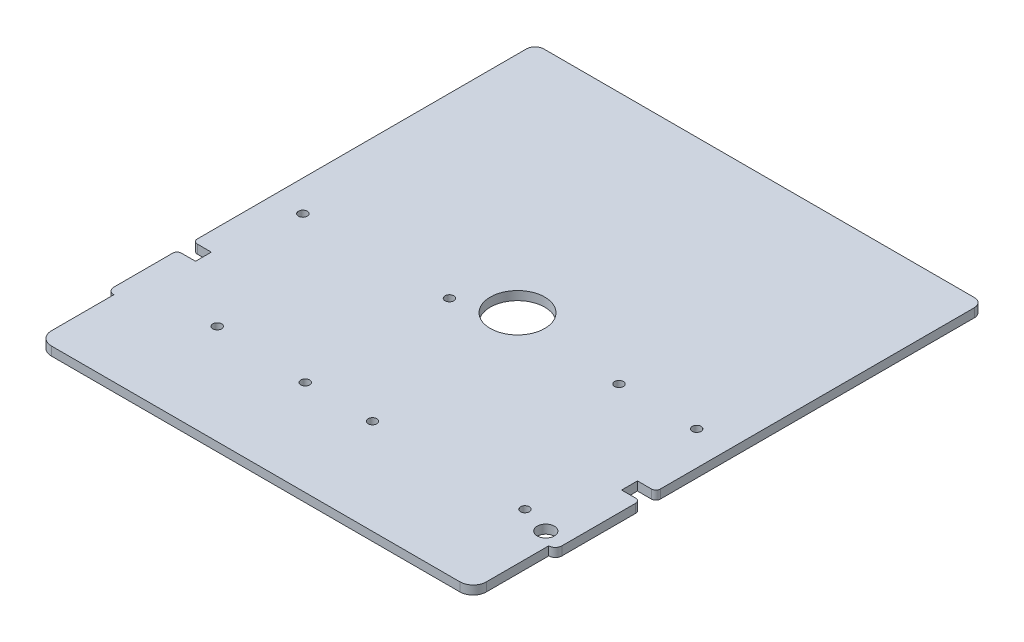
ISO-10303-21;
HEADER;
FILE_DESCRIPTION(('STEP AP214'),'2;1');
FILE_NAME('part.step','',(''),(''),'','','');
FILE_SCHEMA(('AUTOMOTIVE_DESIGN { 1 0 10303 214 1 1 1 1 }'));
ENDSEC;
DATA;
#1=APPLICATION_CONTEXT('core data for automotive mechanical design processes');
#2=APPLICATION_PROTOCOL_DEFINITION('international standard','automotive_design',2000,#1);
#3=PRODUCT_CONTEXT('',#1,'mechanical');
#4=PRODUCT('Part','Part','',(#3));
#5=PRODUCT_RELATED_PRODUCT_CATEGORY('part','',(#4));
#6=PRODUCT_DEFINITION_FORMATION('','',#4);
#7=PRODUCT_DEFINITION_CONTEXT('part definition',#1,'design');
#8=PRODUCT_DEFINITION('design','',#6,#7);
#9=PRODUCT_DEFINITION_SHAPE('','',#8);
#10=(LENGTH_UNIT() NAMED_UNIT(*) SI_UNIT(.MILLI.,.METRE.));
#11=(NAMED_UNIT(*) PLANE_ANGLE_UNIT() SI_UNIT($,.RADIAN.));
#12=(NAMED_UNIT(*) SI_UNIT($,.STERADIAN.) SOLID_ANGLE_UNIT());
#13=UNCERTAINTY_MEASURE_WITH_UNIT(LENGTH_MEASURE(1.E-05),#10,'distance_accuracy_value','');
#14=(GEOMETRIC_REPRESENTATION_CONTEXT(3) GLOBAL_UNCERTAINTY_ASSIGNED_CONTEXT((#13)) GLOBAL_UNIT_ASSIGNED_CONTEXT((#10,
#11,#12)) REPRESENTATION_CONTEXT('',''));
#15=CARTESIAN_POINT('',(0.,0.,0.));
#16=DIRECTION('',(0.,0.,1.));
#17=DIRECTION('',(1.,0.,0.));
#18=AXIS2_PLACEMENT_3D('',#15,#16,#17);
#19=CARTESIAN_POINT('',(0.,1.,1.));
#20=DIRECTION('',(1.,0.,0.));
#21=DIRECTION('',(0.,0.,-1.));
#22=AXIS2_PLACEMENT_3D('',#19,#20,#21);
#23=PLANE('',#22);
#24=DIRECTION('',(0.,0.,1.));
#25=VECTOR('',#24,1.);
#26=CARTESIAN_POINT('',(0.,0.,1.));
#27=LINE('',#26,#25);
#28=CARTESIAN_POINT('',(0.,0.,-25.5));
#29=VERTEX_POINT('',#28);
#30=CARTESIAN_POINT('',(0.,0.,11.95));
#31=VERTEX_POINT('',#30);
#32=EDGE_CURVE('E415',#29,#31,#27,.T.);
#33=ORIENTED_EDGE('',*,*,#32,.T.);
#34=DIRECTION('',(0.,1.,0.));
#35=VECTOR('',#34,1.);
#36=CARTESIAN_POINT('',(0.,1.,11.95));
#37=LINE('',#36,#35);
#38=CARTESIAN_POINT('',(0.,1.,11.95));
#39=VERTEX_POINT('',#38);
#40=EDGE_CURVE('E490',#31,#39,#37,.T.);
#41=ORIENTED_EDGE('',*,*,#40,.T.);
#42=DIRECTION('',(0.,0.,1.));
#43=VECTOR('',#42,1.);
#44=CARTESIAN_POINT('',(0.,1.,1.));
#45=LINE('',#44,#43);
#46=CARTESIAN_POINT('',(0.,1.,-25.5));
#47=VERTEX_POINT('',#46);
#48=EDGE_CURVE('E385',#47,#39,#45,.T.);
#49=ORIENTED_EDGE('',*,*,#48,.F.);
#50=DIRECTION('',(0.,-1.,0.));
#51=VECTOR('',#50,1.);
#52=CARTESIAN_POINT('',(0.,1.,-25.5));
#53=LINE('',#52,#51);
#54=EDGE_CURVE('E461',#47,#29,#53,.T.);
#55=ORIENTED_EDGE('',*,*,#54,.T.);
#56=EDGE_LOOP('',(#33,#41,#49,#55));
#57=FACE_BOUND('',#56,.T.);
#58=ADVANCED_FACE('F151',(#57),#23,.F.);
#59=CARTESIAN_POINT('',(0.,1.,14.75));
#60=VERTEX_POINT('',#59);
#61=CARTESIAN_POINT('',(0.,1.,21.45));
#62=VERTEX_POINT('',#61);
#63=EDGE_CURVE('E384',#60,#62,#45,.T.);
#64=ORIENTED_EDGE('',*,*,#63,.F.);
#65=DIRECTION('',(0.,1.,0.));
#66=VECTOR('',#65,1.);
#67=CARTESIAN_POINT('',(0.,0.,14.75));
#68=LINE('',#67,#66);
#69=CARTESIAN_POINT('',(0.,0.,14.75));
#70=VERTEX_POINT('',#69);
#71=EDGE_CURVE('E481',#60,#70,#68,.F.);
#72=ORIENTED_EDGE('',*,*,#71,.T.);
#73=CARTESIAN_POINT('',(0.,0.,21.45));
#74=VERTEX_POINT('',#73);
#75=EDGE_CURVE('E414',#70,#74,#27,.T.);
#76=ORIENTED_EDGE('',*,*,#75,.T.);
#77=DIRECTION('',(0.,-1.,0.));
#78=VECTOR('',#77,1.);
#79=CARTESIAN_POINT('',(0.,1.,21.45));
#80=LINE('',#79,#78);
#81=EDGE_CURVE('E458',#62,#74,#80,.T.);
#82=ORIENTED_EDGE('',*,*,#81,.F.);
#83=EDGE_LOOP('',(#64,#72,#76,#82));
#84=FACE_BOUND('',#83,.T.);
#85=ADVANCED_FACE('F599',(#84),#23,.F.);
#86=CARTESIAN_POINT('',(51.,1.,-25.5));
#87=DIRECTION('',(-1.,0.,0.));
#88=DIRECTION('',(0.,0.,1.));
#89=AXIS2_PLACEMENT_3D('',#86,#87,#88);
#90=PLANE('',#89);
#91=DIRECTION('',(0.,0.,-1.));
#92=VECTOR('',#91,1.);
#93=CARTESIAN_POINT('',(51.,1.,21.45));
#94=LINE('',#93,#92);
#95=CARTESIAN_POINT('',(51.,1.,10.25));
#96=VERTEX_POINT('',#95);
#97=CARTESIAN_POINT('',(51.,1.,-25.5));
#98=VERTEX_POINT('',#97);
#99=EDGE_CURVE('E402',#96,#98,#94,.T.);
#100=ORIENTED_EDGE('',*,*,#99,.F.);
#101=DIRECTION('',(0.,1.,0.));
#102=VECTOR('',#101,1.);
#103=CARTESIAN_POINT('',(51.,1.,10.25));
#104=LINE('',#103,#102);
#105=CARTESIAN_POINT('',(51.,0.,10.25));
#106=VERTEX_POINT('',#105);
#107=EDGE_CURVE('E12',#96,#106,#104,.F.);
#108=ORIENTED_EDGE('',*,*,#107,.T.);
#109=DIRECTION('',(0.,0.,-1.));
#110=VECTOR('',#109,1.);
#111=CARTESIAN_POINT('',(51.,0.,-25.5));
#112=LINE('',#111,#110);
#113=CARTESIAN_POINT('',(51.,0.,-25.5));
#114=VERTEX_POINT('',#113);
#115=EDGE_CURVE('E433',#106,#114,#112,.T.);
#116=ORIENTED_EDGE('',*,*,#115,.T.);
#117=DIRECTION('',(0.,-1.,0.));
#118=VECTOR('',#117,1.);
#119=CARTESIAN_POINT('',(51.,1.,-25.5));
#120=LINE('',#119,#118);
#121=EDGE_CURVE('E406',#98,#114,#120,.T.);
#122=ORIENTED_EDGE('',*,*,#121,.F.);
#123=EDGE_LOOP('',(#100,#108,#116,#122));
#124=FACE_BOUND('',#123,.T.);
#125=ADVANCED_FACE('F587',(#124),#90,.F.);
#126=CARTESIAN_POINT('',(50.,1.,-25.5));
#127=DIRECTION('',(0.,-1.,0.));
#128=DIRECTION('',(0.,0.,-1.));
#129=AXIS2_PLACEMENT_3D('',#126,#127,#128);
#130=PLANE('',#129);
#131=CARTESIAN_POINT('',(3.52,1.,3.45));
#132=DIRECTION('',(0.,1.,0.));
#133=DIRECTION('',(0.,0.,1.));
#134=AXIS2_PLACEMENT_3D('',#131,#132,#133);
#135=CIRCLE('',#134,0.500000000000001);
#136=CARTESIAN_POINT('',(3.52,1.,3.95));
#137=VERTEX_POINT('',#136);
#138=EDGE_CURVE('E945',#137,#137,#135,.T.);
#139=ORIENTED_EDGE('',*,*,#138,.F.);
#140=EDGE_LOOP('',(#139));
#141=FACE_BOUND('',#140,.T.);
#142=CARTESIAN_POINT('',(9.75,1.,19.43));
#143=DIRECTION('',(0.,1.,0.));
#144=DIRECTION('',(0.,0.,1.));
#145=AXIS2_PLACEMENT_3D('',#142,#143,#144);
#146=CIRCLE('',#145,0.500000000000001);
#147=CARTESIAN_POINT('',(9.75,1.,19.93));
#148=VERTEX_POINT('',#147);
#149=EDGE_CURVE('E972',#148,#148,#146,.T.);
#150=ORIENTED_EDGE('',*,*,#149,.F.);
#151=EDGE_LOOP('',(#150));
#152=FACE_BOUND('',#151,.T.);
#153=CARTESIAN_POINT('',(20.29,1.,19.95));
#154=DIRECTION('',(0.,1.,0.));
#155=DIRECTION('',(0.,0.,1.));
#156=AXIS2_PLACEMENT_3D('',#153,#154,#155);
#157=CIRCLE('',#156,0.499999999999999);
#158=CARTESIAN_POINT('',(20.29,1.,20.45));
#159=VERTEX_POINT('',#158);
#160=EDGE_CURVE('E966',#159,#159,#157,.T.);
#161=ORIENTED_EDGE('',*,*,#160,.F.);
#162=EDGE_LOOP('',(#161));
#163=FACE_BOUND('',#162,.T.);
#164=CARTESIAN_POINT('',(27.94,1.,19.95));
#165=DIRECTION('',(0.,1.,0.));
#166=DIRECTION('',(0.,0.,1.));
#167=AXIS2_PLACEMENT_3D('',#164,#165,#166);
#168=CIRCLE('',#167,0.499999999999999);
#169=CARTESIAN_POINT('',(27.94,1.,20.45));
#170=VERTEX_POINT('',#169);
#171=EDGE_CURVE('E960',#170,#170,#168,.T.);
#172=ORIENTED_EDGE('',*,*,#171,.F.);
#173=EDGE_LOOP('',(#172));
#174=FACE_BOUND('',#173,.T.);
#175=CARTESIAN_POINT('',(45.29,1.,19.95));
#176=DIRECTION('',(0.,1.,0.));
#177=DIRECTION('',(0.,0.,1.));
#178=AXIS2_PLACEMENT_3D('',#175,#176,#177);
#179=CIRCLE('',#178,0.499999999999999);
#180=CARTESIAN_POINT('',(45.29,1.,20.45));
#181=VERTEX_POINT('',#180);
#182=EDGE_CURVE('E953',#181,#181,#179,.T.);
#183=ORIENTED_EDGE('',*,*,#182,.F.);
#184=EDGE_LOOP('',(#183));
#185=FACE_BOUND('',#184,.T.);
#186=CARTESIAN_POINT('',(48.627,1.,20.91));
#187=DIRECTION('',(0.,1.,0.));
#188=DIRECTION('',(0.,0.,1.));
#189=AXIS2_PLACEMENT_3D('',#186,#187,#188);
#190=CIRCLE('',#189,0.975);
#191=CARTESIAN_POINT('',(48.627,1.,21.885));
#192=VERTEX_POINT('',#191);
#193=EDGE_CURVE('E992',#192,#192,#190,.T.);
#194=ORIENTED_EDGE('',*,*,#193,.F.);
#195=EDGE_LOOP('',(#194));
#196=FACE_BOUND('',#195,.T.);
#197=CARTESIAN_POINT('',(47.14,1.,2.25));
#198=DIRECTION('',(0.,1.,0.));
#199=DIRECTION('',(0.,0.,1.));
#200=AXIS2_PLACEMENT_3D('',#197,#198,#199);
#201=CIRCLE('',#200,0.499999999999999);
#202=CARTESIAN_POINT('',(47.14,1.,2.74999999999999));
#203=VERTEX_POINT('',#202);
#204=EDGE_CURVE('E986',#203,#203,#201,.T.);
#205=ORIENTED_EDGE('',*,*,#204,.F.);
#206=EDGE_LOOP('',(#205));
#207=FACE_BOUND('',#206,.T.);
#208=CARTESIAN_POINT('',(38.3,1.,2.25));
#209=DIRECTION('',(0.,1.,0.));
#210=DIRECTION('',(0.,0.,1.));
#211=AXIS2_PLACEMENT_3D('',#208,#209,#210);
#212=CIRCLE('',#211,0.499999999999999);
#213=CARTESIAN_POINT('',(38.3,1.,2.74999999999999));
#214=VERTEX_POINT('',#213);
#215=EDGE_CURVE('E980',#214,#214,#212,.T.);
#216=ORIENTED_EDGE('',*,*,#215,.F.);
#217=EDGE_LOOP('',(#216));
#218=FACE_BOUND('',#217,.T.);
#219=CARTESIAN_POINT('',(20.2,1.,3.45));
#220=DIRECTION('',(0.,1.,0.));
#221=DIRECTION('',(0.,0.,1.));
#222=AXIS2_PLACEMENT_3D('',#219,#220,#221);
#223=CIRCLE('',#222,0.499999999999999);
#224=CARTESIAN_POINT('',(20.2,1.,3.95));
#225=VERTEX_POINT('',#224);
#226=EDGE_CURVE('E946',#225,#225,#223,.T.);
#227=ORIENTED_EDGE('',*,*,#226,.F.);
#228=EDGE_LOOP('',(#227));
#229=FACE_BOUND('',#228,.T.);
#230=CARTESIAN_POINT('',(25.5,1.,1.));
#231=DIRECTION('',(0.,-1.,0.));
#232=DIRECTION('',(0.,0.,-1.));
#233=AXIS2_PLACEMENT_3D('',#230,#231,#232);
#234=CIRCLE('',#233,3.1);
#235=CARTESIAN_POINT('',(25.5,1.,-2.1));
#236=VERTEX_POINT('',#235);
#237=EDGE_CURVE('E367',#236,#236,#234,.F.);
#238=ORIENTED_EDGE('',*,*,#237,.F.);
#239=EDGE_LOOP('',(#238));
#240=FACE_BOUND('',#239,.T.);
#241=DIRECTION('',(1.,0.,0.));
#242=VECTOR('',#241,1.);
#243=CARTESIAN_POINT('',(50.,1.,14.25));
#244=LINE('',#243,#242);
#245=CARTESIAN_POINT('',(0.5,1.,14.25));
#246=VERTEX_POINT('',#245);
#247=CARTESIAN_POINT('',(2.1,1.,14.25));
#248=VERTEX_POINT('',#247);
#249=EDGE_CURVE('E370',#246,#248,#244,.T.);
#250=ORIENTED_EDGE('',*,*,#249,.F.);
#251=CARTESIAN_POINT('',(0.500000000000002,1.,14.75));
#252=DIRECTION('',(0.,-1.,0.));
#253=DIRECTION('',(0.,0.,-1.));
#254=AXIS2_PLACEMENT_3D('',#251,#252,#253);
#255=CIRCLE('',#254,0.5);
#256=EDGE_CURVE('E479',#246,#60,#255,.F.);
#257=ORIENTED_EDGE('',*,*,#256,.T.);
#258=ORIENTED_EDGE('',*,*,#63,.T.);
#259=CARTESIAN_POINT('',(0.750000000000003,1.,21.45));
#260=DIRECTION('',(0.,1.,0.));
#261=DIRECTION('',(0.,0.,1.));
#262=AXIS2_PLACEMENT_3D('',#259,#260,#261);
#263=CIRCLE('',#262,0.750000000000007);
#264=CARTESIAN_POINT('',(0.750000000000003,1.,22.2));
#265=VERTEX_POINT('',#264);
#266=EDGE_CURVE('E388',#62,#265,#263,.T.);
#267=ORIENTED_EDGE('',*,*,#266,.T.);
#268=DIRECTION('',(0.,0.,1.));
#269=VECTOR('',#268,1.);
#270=CARTESIAN_POINT('',(0.750000000000001,1.,22.2));
#271=LINE('',#270,#269);
#272=CARTESIAN_POINT('',(0.750000000000003,1.,29.3));
#273=VERTEX_POINT('',#272);
#274=EDGE_CURVE('E390',#265,#273,#271,.T.);
#275=ORIENTED_EDGE('',*,*,#274,.T.);
#276=CARTESIAN_POINT('',(2.25,1.,29.3));
#277=DIRECTION('',(0.,1.,0.));
#278=DIRECTION('',(0.,0.,1.));
#279=AXIS2_PLACEMENT_3D('',#276,#277,#278);
#280=CIRCLE('',#279,1.5);
#281=CARTESIAN_POINT('',(2.25,1.,30.8));
#282=VERTEX_POINT('',#281);
#283=EDGE_CURVE('E392',#273,#282,#280,.T.);
#284=ORIENTED_EDGE('',*,*,#283,.T.);
#285=DIRECTION('',(1.,0.,0.));
#286=VECTOR('',#285,1.);
#287=CARTESIAN_POINT('',(2.25,1.,30.8));
#288=LINE('',#287,#286);
#289=CARTESIAN_POINT('',(48.75,1.,30.8));
#290=VERTEX_POINT('',#289);
#291=EDGE_CURVE('E394',#282,#290,#288,.T.);
#292=ORIENTED_EDGE('',*,*,#291,.T.);
#293=CARTESIAN_POINT('',(48.75,1.,29.3));
#294=DIRECTION('',(0.,1.,0.));
#295=DIRECTION('',(0.,0.,1.));
#296=AXIS2_PLACEMENT_3D('',#293,#294,#295);
#297=CIRCLE('',#296,1.5);
#298=CARTESIAN_POINT('',(50.25,1.,29.3));
#299=VERTEX_POINT('',#298);
#300=EDGE_CURVE('E396',#290,#299,#297,.T.);
#301=ORIENTED_EDGE('',*,*,#300,.T.);
#302=DIRECTION('',(0.,0.,-1.));
#303=VECTOR('',#302,1.);
#304=CARTESIAN_POINT('',(50.25,1.,29.3));
#305=LINE('',#304,#303);
#306=CARTESIAN_POINT('',(50.25,1.,22.2));
#307=VERTEX_POINT('',#306);
#308=EDGE_CURVE('E398',#299,#307,#305,.T.);
#309=ORIENTED_EDGE('',*,*,#308,.T.);
#310=CARTESIAN_POINT('',(50.25,1.,21.45));
#311=DIRECTION('',(0.,1.,0.));
#312=DIRECTION('',(0.,0.,1.));
#313=AXIS2_PLACEMENT_3D('',#310,#311,#312);
#314=CIRCLE('',#313,0.750000000000011);
#315=CARTESIAN_POINT('',(51.,1.,21.45));
#316=VERTEX_POINT('',#315);
#317=EDGE_CURVE('E400',#307,#316,#314,.T.);
#318=ORIENTED_EDGE('',*,*,#317,.T.);
#319=CARTESIAN_POINT('',(51.,1.,13.05));
#320=VERTEX_POINT('',#319);
#321=EDGE_CURVE('E403',#316,#320,#94,.T.);
#322=ORIENTED_EDGE('',*,*,#321,.T.);
#323=CARTESIAN_POINT('',(50.5,1.,13.05));
#324=DIRECTION('',(0.,-1.,0.));
#325=DIRECTION('',(0.,0.,-1.));
#326=AXIS2_PLACEMENT_3D('',#323,#324,#325);
#327=CIRCLE('',#326,0.5);
#328=CARTESIAN_POINT('',(50.5,1.,12.55));
#329=VERTEX_POINT('',#328);
#330=EDGE_CURVE('E475',#320,#329,#327,.F.);
#331=ORIENTED_EDGE('',*,*,#330,.T.);
#332=DIRECTION('',(-1.,0.,0.));
#333=VECTOR('',#332,1.);
#334=CARTESIAN_POINT('',(50.,1.,12.55));
#335=LINE('',#334,#333);
#336=CARTESIAN_POINT('',(48.9,1.,12.55));
#337=VERTEX_POINT('',#336);
#338=EDGE_CURVE('E362',#329,#337,#335,.T.);
#339=ORIENTED_EDGE('',*,*,#338,.T.);
#340=DIRECTION('',(0.,0.,-1.));
#341=VECTOR('',#340,1.);
#342=CARTESIAN_POINT('',(48.9,1.,-25.5));
#343=LINE('',#342,#341);
#344=CARTESIAN_POINT('',(48.9,1.,10.75));
#345=VERTEX_POINT('',#344);
#346=EDGE_CURVE('E332',#337,#345,#343,.T.);
#347=ORIENTED_EDGE('',*,*,#346,.T.);
#348=DIRECTION('',(1.,0.,0.));
#349=VECTOR('',#348,1.);
#350=CARTESIAN_POINT('',(50.,1.,10.75));
#351=LINE('',#350,#349);
#352=CARTESIAN_POINT('',(50.5,1.,10.75));
#353=VERTEX_POINT('',#352);
#354=EDGE_CURVE('E364',#345,#353,#351,.T.);
#355=ORIENTED_EDGE('',*,*,#354,.T.);
#356=CARTESIAN_POINT('',(50.5,1.,10.25));
#357=DIRECTION('',(0.,-1.,0.));
#358=DIRECTION('',(0.,0.,-1.));
#359=AXIS2_PLACEMENT_3D('',#356,#357,#358);
#360=CIRCLE('',#359,0.5);
#361=EDGE_CURVE('E473',#353,#96,#360,.F.);
#362=ORIENTED_EDGE('',*,*,#361,.T.);
#363=ORIENTED_EDGE('',*,*,#99,.T.);
#364=CARTESIAN_POINT('',(50.,1.,-25.5));
#365=DIRECTION('',(0.,1.,0.));
#366=DIRECTION('',(0.,0.,-1.));
#367=AXIS2_PLACEMENT_3D('',#364,#365,#366);
#368=CIRCLE('',#367,1.);
#369=CARTESIAN_POINT('',(50.,1.,-26.5));
#370=VERTEX_POINT('',#369);
#371=EDGE_CURVE('E376',#98,#370,#368,.T.);
#372=ORIENTED_EDGE('',*,*,#371,.T.);
#373=DIRECTION('',(-1.,0.,0.));
#374=VECTOR('',#373,1.);
#375=CARTESIAN_POINT('',(1.00000000000001,1.,-26.5));
#376=LINE('',#375,#374);
#377=CARTESIAN_POINT('',(1.00000000000001,1.,-26.5));
#378=VERTEX_POINT('',#377);
#379=EDGE_CURVE('E379',#370,#378,#376,.T.);
#380=ORIENTED_EDGE('',*,*,#379,.T.);
#381=CARTESIAN_POINT('',(1.,1.,-25.5));
#382=DIRECTION('',(0.,1.,0.));
#383=DIRECTION('',(0.,0.,-1.));
#384=AXIS2_PLACEMENT_3D('',#381,#382,#383);
#385=CIRCLE('',#384,1.);
#386=EDGE_CURVE('E382',#378,#47,#385,.T.);
#387=ORIENTED_EDGE('',*,*,#386,.T.);
#388=ORIENTED_EDGE('',*,*,#48,.T.);
#389=CARTESIAN_POINT('',(0.500000000000002,1.,11.95));
#390=DIRECTION('',(0.,-1.,0.));
#391=DIRECTION('',(0.,0.,-1.));
#392=AXIS2_PLACEMENT_3D('',#389,#390,#391);
#393=CIRCLE('',#392,0.5);
#394=CARTESIAN_POINT('',(0.5,1.,12.45));
#395=VERTEX_POINT('',#394);
#396=EDGE_CURVE('E477',#39,#395,#393,.F.);
#397=ORIENTED_EDGE('',*,*,#396,.T.);
#398=DIRECTION('',(-1.,0.,0.));
#399=VECTOR('',#398,1.);
#400=CARTESIAN_POINT('',(50.,1.,12.45));
#401=LINE('',#400,#399);
#402=CARTESIAN_POINT('',(2.1,1.,12.45));
#403=VERTEX_POINT('',#402);
#404=EDGE_CURVE('E373',#403,#395,#401,.T.);
#405=ORIENTED_EDGE('',*,*,#404,.F.);
#406=DIRECTION('',(0.,0.,-1.));
#407=VECTOR('',#406,1.);
#408=CARTESIAN_POINT('',(2.09999999999997,1.,-25.5));
#409=LINE('',#408,#407);
#410=EDGE_CURVE('E331',#248,#403,#409,.T.);
#411=ORIENTED_EDGE('',*,*,#410,.F.);
#412=EDGE_LOOP('',(#250,#257,#258,#267,#275,#284,#292,#301,#309,#318,#322,#331,#339,#347,#355,
#362,#363,#372,#380,#387,#388,#397,#405,#411));
#413=FACE_BOUND('',#412,.T.);
#414=ADVANCED_FACE('F507',(#141,#152,#163,#174,#185,#196,#207,#218,#229,#240,#413),#130,.F.);
#415=CARTESIAN_POINT('',(50.,0.,-25.5));
#416=DIRECTION('',(0.,-1.,0.));
#417=DIRECTION('',(0.,0.,-1.));
#418=AXIS2_PLACEMENT_3D('',#415,#416,#417);
#419=PLANE('',#418);
#420=CARTESIAN_POINT('',(3.52,0.,3.45));
#421=DIRECTION('',(0.,1.,0.));
#422=DIRECTION('',(0.,0.,1.));
#423=AXIS2_PLACEMENT_3D('',#420,#421,#422);
#424=CIRCLE('',#423,0.500000000000001);
#425=CARTESIAN_POINT('',(3.52,0.,3.95));
#426=VERTEX_POINT('',#425);
#427=EDGE_CURVE('E354',#426,#426,#424,.T.);
#428=ORIENTED_EDGE('',*,*,#427,.T.);
#429=EDGE_LOOP('',(#428));
#430=FACE_BOUND('',#429,.T.);
#431=CARTESIAN_POINT('',(9.75,0.,19.43));
#432=DIRECTION('',(0.,1.,0.));
#433=DIRECTION('',(0.,0.,1.));
#434=AXIS2_PLACEMENT_3D('',#431,#432,#433);
#435=CIRCLE('',#434,0.500000000000001);
#436=CARTESIAN_POINT('',(9.75,0.,19.93));
#437=VERTEX_POINT('',#436);
#438=EDGE_CURVE('E975',#437,#437,#435,.T.);
#439=ORIENTED_EDGE('',*,*,#438,.T.);
#440=EDGE_LOOP('',(#439));
#441=FACE_BOUND('',#440,.T.);
#442=CARTESIAN_POINT('',(20.29,0.,19.95));
#443=DIRECTION('',(0.,1.,0.));
#444=DIRECTION('',(0.,0.,1.));
#445=AXIS2_PLACEMENT_3D('',#442,#443,#444);
#446=CIRCLE('',#445,0.499999999999999);
#447=CARTESIAN_POINT('',(20.29,0.,20.45));
#448=VERTEX_POINT('',#447);
#449=EDGE_CURVE('E969',#448,#448,#446,.T.);
#450=ORIENTED_EDGE('',*,*,#449,.T.);
#451=EDGE_LOOP('',(#450));
#452=FACE_BOUND('',#451,.T.);
#453=CARTESIAN_POINT('',(27.94,0.,19.95));
#454=DIRECTION('',(0.,1.,0.));
#455=DIRECTION('',(0.,0.,1.));
#456=AXIS2_PLACEMENT_3D('',#453,#454,#455);
#457=CIRCLE('',#456,0.499999999999999);
#458=CARTESIAN_POINT('',(27.94,0.,20.45));
#459=VERTEX_POINT('',#458);
#460=EDGE_CURVE('E963',#459,#459,#457,.T.);
#461=ORIENTED_EDGE('',*,*,#460,.T.);
#462=EDGE_LOOP('',(#461));
#463=FACE_BOUND('',#462,.T.);
#464=CARTESIAN_POINT('',(45.29,0.,19.95));
#465=DIRECTION('',(0.,1.,0.));
#466=DIRECTION('',(0.,0.,1.));
#467=AXIS2_PLACEMENT_3D('',#464,#465,#466);
#468=CIRCLE('',#467,0.499999999999999);
#469=CARTESIAN_POINT('',(45.29,0.,20.45));
#470=VERTEX_POINT('',#469);
#471=EDGE_CURVE('E957',#470,#470,#468,.T.);
#472=ORIENTED_EDGE('',*,*,#471,.T.);
#473=EDGE_LOOP('',(#472));
#474=FACE_BOUND('',#473,.T.);
#475=CARTESIAN_POINT('',(48.627,0.,20.91));
#476=DIRECTION('',(0.,1.,0.));
#477=DIRECTION('',(0.,0.,1.));
#478=AXIS2_PLACEMENT_3D('',#475,#476,#477);
#479=CIRCLE('',#478,0.975);
#480=CARTESIAN_POINT('',(48.627,0.,21.885));
#481=VERTEX_POINT('',#480);
#482=EDGE_CURVE('E956',#481,#481,#479,.T.);
#483=ORIENTED_EDGE('',*,*,#482,.T.);
#484=EDGE_LOOP('',(#483));
#485=FACE_BOUND('',#484,.T.);
#486=CARTESIAN_POINT('',(47.14,0.,2.25));
#487=DIRECTION('',(0.,1.,0.));
#488=DIRECTION('',(0.,0.,1.));
#489=AXIS2_PLACEMENT_3D('',#486,#487,#488);
#490=CIRCLE('',#489,0.499999999999999);
#491=CARTESIAN_POINT('',(47.14,0.,2.74999999999999));
#492=VERTEX_POINT('',#491);
#493=EDGE_CURVE('E989',#492,#492,#490,.T.);
#494=ORIENTED_EDGE('',*,*,#493,.T.);
#495=EDGE_LOOP('',(#494));
#496=FACE_BOUND('',#495,.T.);
#497=CARTESIAN_POINT('',(38.3,0.,2.25));
#498=DIRECTION('',(0.,1.,0.));
#499=DIRECTION('',(0.,0.,1.));
#500=AXIS2_PLACEMENT_3D('',#497,#498,#499);
#501=CIRCLE('',#500,0.499999999999999);
#502=CARTESIAN_POINT('',(38.3,0.,2.74999999999999));
#503=VERTEX_POINT('',#502);
#504=EDGE_CURVE('E983',#503,#503,#501,.T.);
#505=ORIENTED_EDGE('',*,*,#504,.T.);
#506=EDGE_LOOP('',(#505));
#507=FACE_BOUND('',#506,.T.);
#508=CARTESIAN_POINT('',(20.2,0.,3.45));
#509=DIRECTION('',(0.,1.,0.));
#510=DIRECTION('',(0.,0.,1.));
#511=AXIS2_PLACEMENT_3D('',#508,#509,#510);
#512=CIRCLE('',#511,0.499999999999999);
#513=CARTESIAN_POINT('',(20.2,0.,3.95));
#514=VERTEX_POINT('',#513);
#515=EDGE_CURVE('E950',#514,#514,#512,.T.);
#516=ORIENTED_EDGE('',*,*,#515,.T.);
#517=EDGE_LOOP('',(#516));
#518=FACE_BOUND('',#517,.T.);
#519=CARTESIAN_POINT('',(25.5,0.,1.));
#520=DIRECTION('',(0.,1.,0.));
#521=DIRECTION('',(0.,0.,1.));
#522=AXIS2_PLACEMENT_3D('',#519,#520,#521);
#523=CIRCLE('',#522,3.1);
#524=CARTESIAN_POINT('',(25.5,0.,4.1));
#525=VERTEX_POINT('',#524);
#526=EDGE_CURVE('E339',#525,#525,#523,.F.);
#527=ORIENTED_EDGE('',*,*,#526,.F.);
#528=EDGE_LOOP('',(#527));
#529=FACE_BOUND('',#528,.T.);
#530=ORIENTED_EDGE('',*,*,#75,.F.);
#531=CARTESIAN_POINT('',(0.500000000000002,0.,14.75));
#532=DIRECTION('',(0.,-1.,0.));
#533=DIRECTION('',(0.,0.,-1.));
#534=AXIS2_PLACEMENT_3D('',#531,#532,#533);
#535=CIRCLE('',#534,0.5);
#536=CARTESIAN_POINT('',(0.500000000000002,0.,14.25));
#537=VERTEX_POINT('',#536);
#538=EDGE_CURVE('E488',#70,#537,#535,.T.);
#539=ORIENTED_EDGE('',*,*,#538,.T.);
#540=DIRECTION('',(-1.,0.,0.));
#541=VECTOR('',#540,1.);
#542=CARTESIAN_POINT('',(0.,0.,14.25));
#543=LINE('',#542,#541);
#544=CARTESIAN_POINT('',(2.1,0.,14.25));
#545=VERTEX_POINT('',#544);
#546=EDGE_CURVE('E337',#545,#537,#543,.T.);
#547=ORIENTED_EDGE('',*,*,#546,.F.);
#548=DIRECTION('',(0.,0.,1.));
#549=VECTOR('',#548,1.);
#550=CARTESIAN_POINT('',(2.09999999999999,0.,0.));
#551=LINE('',#550,#549);
#552=CARTESIAN_POINT('',(2.1,0.,12.45));
#553=VERTEX_POINT('',#552);
#554=EDGE_CURVE('E323',#553,#545,#551,.T.);
#555=ORIENTED_EDGE('',*,*,#554,.F.);
#556=DIRECTION('',(1.,0.,0.));
#557=VECTOR('',#556,1.);
#558=CARTESIAN_POINT('',(0.,0.,12.45));
#559=LINE('',#558,#557);
#560=CARTESIAN_POINT('',(0.500000000000002,0.,12.45));
#561=VERTEX_POINT('',#560);
#562=EDGE_CURVE('E312',#561,#553,#559,.T.);
#563=ORIENTED_EDGE('',*,*,#562,.F.);
#564=CARTESIAN_POINT('',(0.500000000000002,0.,11.95));
#565=DIRECTION('',(0.,-1.,0.));
#566=DIRECTION('',(0.,0.,-1.));
#567=AXIS2_PLACEMENT_3D('',#564,#565,#566);
#568=CIRCLE('',#567,0.5);
#569=EDGE_CURVE('E486',#561,#31,#568,.T.);
#570=ORIENTED_EDGE('',*,*,#569,.T.);
#571=ORIENTED_EDGE('',*,*,#32,.F.);
#572=CARTESIAN_POINT('',(1.,0.,-25.5));
#573=DIRECTION('',(0.,1.,0.));
#574=DIRECTION('',(0.,0.,-1.));
#575=AXIS2_PLACEMENT_3D('',#572,#573,#574);
#576=CIRCLE('',#575,1.);
#577=CARTESIAN_POINT('',(1.00000000000001,0.,-26.5));
#578=VERTEX_POINT('',#577);
#579=EDGE_CURVE('E411',#578,#29,#576,.T.);
#580=ORIENTED_EDGE('',*,*,#579,.F.);
#581=DIRECTION('',(-1.,0.,0.));
#582=VECTOR('',#581,1.);
#583=CARTESIAN_POINT('',(1.00000000000001,0.,-26.5));
#584=LINE('',#583,#582);
#585=CARTESIAN_POINT('',(50.,0.,-26.5));
#586=VERTEX_POINT('',#585);
#587=EDGE_CURVE('E409',#586,#578,#584,.T.);
#588=ORIENTED_EDGE('',*,*,#587,.F.);
#589=CARTESIAN_POINT('',(50.,0.,-25.5));
#590=DIRECTION('',(0.,1.,0.));
#591=DIRECTION('',(0.,0.,-1.));
#592=AXIS2_PLACEMENT_3D('',#589,#590,#591);
#593=CIRCLE('',#592,1.);
#594=EDGE_CURVE('E375',#114,#586,#593,.T.);
#595=ORIENTED_EDGE('',*,*,#594,.F.);
#596=ORIENTED_EDGE('',*,*,#115,.F.);
#597=CARTESIAN_POINT('',(50.5,0.,10.25));
#598=DIRECTION('',(0.,-1.,0.));
#599=DIRECTION('',(0.,0.,-1.));
#600=AXIS2_PLACEMENT_3D('',#597,#598,#599);
#601=CIRCLE('',#600,0.5);
#602=CARTESIAN_POINT('',(50.5,0.,10.75));
#603=VERTEX_POINT('',#602);
#604=EDGE_CURVE('E483',#106,#603,#601,.T.);
#605=ORIENTED_EDGE('',*,*,#604,.T.);
#606=DIRECTION('',(-1.,0.,0.));
#607=VECTOR('',#606,1.);
#608=CARTESIAN_POINT('',(0.,0.,10.75));
#609=LINE('',#608,#607);
#610=CARTESIAN_POINT('',(48.9,0.,10.75));
#611=VERTEX_POINT('',#610);
#612=EDGE_CURVE('E350',#603,#611,#609,.T.);
#613=ORIENTED_EDGE('',*,*,#612,.T.);
#614=DIRECTION('',(0.,0.,1.));
#615=VECTOR('',#614,1.);
#616=CARTESIAN_POINT('',(48.9,0.,0.));
#617=LINE('',#616,#615);
#618=CARTESIAN_POINT('',(48.9,0.,12.55));
#619=VERTEX_POINT('',#618);
#620=EDGE_CURVE('E346',#611,#619,#617,.T.);
#621=ORIENTED_EDGE('',*,*,#620,.T.);
#622=DIRECTION('',(1.,0.,0.));
#623=VECTOR('',#622,1.);
#624=CARTESIAN_POINT('',(0.,0.,12.55));
#625=LINE('',#624,#623);
#626=CARTESIAN_POINT('',(50.5,0.,12.55));
#627=VERTEX_POINT('',#626);
#628=EDGE_CURVE('E356',#619,#627,#625,.T.);
#629=ORIENTED_EDGE('',*,*,#628,.T.);
#630=CARTESIAN_POINT('',(50.5,0.,13.05));
#631=DIRECTION('',(0.,-1.,0.));
#632=DIRECTION('',(0.,0.,-1.));
#633=AXIS2_PLACEMENT_3D('',#630,#631,#632);
#634=CIRCLE('',#633,0.5);
#635=CARTESIAN_POINT('',(51.,0.,13.05));
#636=VERTEX_POINT('',#635);
#637=EDGE_CURVE('E166',#627,#636,#634,.T.);
#638=ORIENTED_EDGE('',*,*,#637,.T.);
#639=CARTESIAN_POINT('',(51.,0.,21.45));
#640=VERTEX_POINT('',#639);
#641=EDGE_CURVE('E380',#640,#636,#112,.T.);
#642=ORIENTED_EDGE('',*,*,#641,.F.);
#643=CARTESIAN_POINT('',(50.25,0.,21.45));
#644=DIRECTION('',(0.,1.,0.));
#645=DIRECTION('',(0.,0.,1.));
#646=AXIS2_PLACEMENT_3D('',#643,#644,#645);
#647=CIRCLE('',#646,0.750000000000011);
#648=CARTESIAN_POINT('',(50.25,0.,22.2));
#649=VERTEX_POINT('',#648);
#650=EDGE_CURVE('E430',#649,#640,#647,.T.);
#651=ORIENTED_EDGE('',*,*,#650,.F.);
#652=DIRECTION('',(0.,0.,-1.));
#653=VECTOR('',#652,1.);
#654=CARTESIAN_POINT('',(50.25,0.,29.3));
#655=LINE('',#654,#653);
#656=CARTESIAN_POINT('',(50.25,0.,29.3));
#657=VERTEX_POINT('',#656);
#658=EDGE_CURVE('E428',#657,#649,#655,.T.);
#659=ORIENTED_EDGE('',*,*,#658,.F.);
#660=CARTESIAN_POINT('',(48.75,0.,29.3));
#661=DIRECTION('',(0.,1.,0.));
#662=DIRECTION('',(0.,0.,1.));
#663=AXIS2_PLACEMENT_3D('',#660,#661,#662);
#664=CIRCLE('',#663,1.5);
#665=CARTESIAN_POINT('',(48.75,0.,30.8));
#666=VERTEX_POINT('',#665);
#667=EDGE_CURVE('E426',#666,#657,#664,.T.);
#668=ORIENTED_EDGE('',*,*,#667,.F.);
#669=DIRECTION('',(1.,0.,0.));
#670=VECTOR('',#669,1.);
#671=CARTESIAN_POINT('',(2.25,0.,30.8));
#672=LINE('',#671,#670);
#673=CARTESIAN_POINT('',(2.25,0.,30.8));
#674=VERTEX_POINT('',#673);
#675=EDGE_CURVE('E424',#674,#666,#672,.T.);
#676=ORIENTED_EDGE('',*,*,#675,.F.);
#677=CARTESIAN_POINT('',(2.25,0.,29.3));
#678=DIRECTION('',(0.,1.,0.));
#679=DIRECTION('',(0.,0.,1.));
#680=AXIS2_PLACEMENT_3D('',#677,#678,#679);
#681=CIRCLE('',#680,1.5);
#682=CARTESIAN_POINT('',(0.750000000000003,0.,29.3));
#683=VERTEX_POINT('',#682);
#684=EDGE_CURVE('E422',#683,#674,#681,.T.);
#685=ORIENTED_EDGE('',*,*,#684,.F.);
#686=DIRECTION('',(0.,0.,1.));
#687=VECTOR('',#686,1.);
#688=CARTESIAN_POINT('',(0.750000000000001,0.,22.2));
#689=LINE('',#688,#687);
#690=CARTESIAN_POINT('',(0.750000000000003,0.,22.2));
#691=VERTEX_POINT('',#690);
#692=EDGE_CURVE('E420',#691,#683,#689,.T.);
#693=ORIENTED_EDGE('',*,*,#692,.F.);
#694=CARTESIAN_POINT('',(0.750000000000003,0.,21.45));
#695=DIRECTION('',(0.,1.,0.));
#696=DIRECTION('',(0.,0.,1.));
#697=AXIS2_PLACEMENT_3D('',#694,#695,#696);
#698=CIRCLE('',#697,0.750000000000007);
#699=EDGE_CURVE('E418',#74,#691,#698,.T.);
#700=ORIENTED_EDGE('',*,*,#699,.F.);
#701=EDGE_LOOP('',(#530,#539,#547,#555,#563,#570,#571,#580,#588,#595,#596,#605,#613,#621,#629,
#638,#642,#651,#659,#668,#676,#685,#693,#700));
#702=FACE_BOUND('',#701,.T.);
#703=ADVANCED_FACE('F335',(#430,#441,#452,#463,#474,#485,#496,#507,#518,#529,#702),#419,.T.);
#704=CARTESIAN_POINT('',(50.,1.,-25.5));
#705=DIRECTION('',(0.,-1.,0.));
#706=DIRECTION('',(0.,0.,-1.));
#707=AXIS2_PLACEMENT_3D('',#704,#705,#706);
#708=CYLINDRICAL_SURFACE('',#707,1.);
#709=ORIENTED_EDGE('',*,*,#594,.T.);
#710=DIRECTION('',(0.,-1.,0.));
#711=VECTOR('',#710,1.);
#712=CARTESIAN_POINT('',(50.,1.,-26.5));
#713=LINE('',#712,#711);
#714=EDGE_CURVE('E467',#370,#586,#713,.T.);
#715=ORIENTED_EDGE('',*,*,#714,.F.);
#716=ORIENTED_EDGE('',*,*,#371,.F.);
#717=ORIENTED_EDGE('',*,*,#121,.T.);
#718=EDGE_LOOP('',(#709,#715,#716,#717));
#719=FACE_BOUND('',#718,.T.);
#720=ADVANCED_FACE('F584',(#719),#708,.T.);
#721=CARTESIAN_POINT('',(1.00000000000001,1.,-26.5));
#722=DIRECTION('',(0.,0.,1.));
#723=DIRECTION('',(1.,0.,0.));
#724=AXIS2_PLACEMENT_3D('',#721,#722,#723);
#725=PLANE('',#724);
#726=ORIENTED_EDGE('',*,*,#587,.T.);
#727=DIRECTION('',(0.,-1.,0.));
#728=VECTOR('',#727,1.);
#729=CARTESIAN_POINT('',(1.00000000000001,1.,-26.5));
#730=LINE('',#729,#728);
#731=EDGE_CURVE('E464',#378,#578,#730,.T.);
#732=ORIENTED_EDGE('',*,*,#731,.F.);
#733=ORIENTED_EDGE('',*,*,#379,.F.);
#734=ORIENTED_EDGE('',*,*,#714,.T.);
#735=EDGE_LOOP('',(#726,#732,#733,#734));
#736=FACE_BOUND('',#735,.T.);
#737=ADVANCED_FACE('F581',(#736),#725,.F.);
#738=CARTESIAN_POINT('',(1.,1.,-25.5));
#739=DIRECTION('',(0.,-1.,0.));
#740=DIRECTION('',(0.,0.,-1.));
#741=AXIS2_PLACEMENT_3D('',#738,#739,#740);
#742=CYLINDRICAL_SURFACE('',#741,1.);
#743=ORIENTED_EDGE('',*,*,#579,.T.);
#744=ORIENTED_EDGE('',*,*,#54,.F.);
#745=ORIENTED_EDGE('',*,*,#386,.F.);
#746=ORIENTED_EDGE('',*,*,#731,.T.);
#747=EDGE_LOOP('',(#743,#744,#745,#746));
#748=FACE_BOUND('',#747,.T.);
#749=ADVANCED_FACE('F575',(#748),#742,.T.);
#750=CARTESIAN_POINT('',(0.750000000000003,1.,21.45));
#751=DIRECTION('',(0.,-1.,0.));
#752=DIRECTION('',(0.,0.,-1.));
#753=AXIS2_PLACEMENT_3D('',#750,#751,#752);
#754=CYLINDRICAL_SURFACE('',#753,0.750000000000007);
#755=ORIENTED_EDGE('',*,*,#699,.T.);
#756=DIRECTION('',(0.,-1.,0.));
#757=VECTOR('',#756,1.);
#758=CARTESIAN_POINT('',(0.750000000000003,1.,22.2));
#759=LINE('',#758,#757);
#760=EDGE_CURVE('E455',#265,#691,#759,.T.);
#761=ORIENTED_EDGE('',*,*,#760,.F.);
#762=ORIENTED_EDGE('',*,*,#266,.F.);
#763=ORIENTED_EDGE('',*,*,#81,.T.);
#764=EDGE_LOOP('',(#755,#761,#762,#763));
#765=FACE_BOUND('',#764,.T.);
#766=ADVANCED_FACE('F555',(#765),#754,.T.);
#767=CARTESIAN_POINT('',(0.750000000000001,1.,22.2));
#768=DIRECTION('',(1.,0.,0.));
#769=DIRECTION('',(0.,0.,-1.));
#770=AXIS2_PLACEMENT_3D('',#767,#768,#769);
#771=PLANE('',#770);
#772=ORIENTED_EDGE('',*,*,#692,.T.);
#773=DIRECTION('',(0.,-1.,0.));
#774=VECTOR('',#773,1.);
#775=CARTESIAN_POINT('',(0.750000000000003,1.,29.3));
#776=LINE('',#775,#774);
#777=EDGE_CURVE('E452',#273,#683,#776,.T.);
#778=ORIENTED_EDGE('',*,*,#777,.F.);
#779=ORIENTED_EDGE('',*,*,#274,.F.);
#780=ORIENTED_EDGE('',*,*,#760,.T.);
#781=EDGE_LOOP('',(#772,#778,#779,#780));
#782=FACE_BOUND('',#781,.T.);
#783=ADVANCED_FACE('F551',(#782),#771,.F.);
#784=CARTESIAN_POINT('',(2.25,1.,29.3));
#785=DIRECTION('',(0.,-1.,0.));
#786=DIRECTION('',(0.,0.,-1.));
#787=AXIS2_PLACEMENT_3D('',#784,#785,#786);
#788=CYLINDRICAL_SURFACE('',#787,1.5);
#789=ORIENTED_EDGE('',*,*,#684,.T.);
#790=DIRECTION('',(0.,-1.,0.));
#791=VECTOR('',#790,1.);
#792=CARTESIAN_POINT('',(2.25,1.,30.8));
#793=LINE('',#792,#791);
#794=EDGE_CURVE('E449',#282,#674,#793,.T.);
#795=ORIENTED_EDGE('',*,*,#794,.F.);
#796=ORIENTED_EDGE('',*,*,#283,.F.);
#797=ORIENTED_EDGE('',*,*,#777,.T.);
#798=EDGE_LOOP('',(#789,#795,#796,#797));
#799=FACE_BOUND('',#798,.T.);
#800=ADVANCED_FACE('F546',(#799),#788,.T.);
#801=CARTESIAN_POINT('',(2.25,1.,30.8));
#802=DIRECTION('',(0.,0.,-1.));
#803=DIRECTION('',(-1.,0.,0.));
#804=AXIS2_PLACEMENT_3D('',#801,#802,#803);
#805=PLANE('',#804);
#806=ORIENTED_EDGE('',*,*,#675,.T.);
#807=DIRECTION('',(0.,-1.,0.));
#808=VECTOR('',#807,1.);
#809=CARTESIAN_POINT('',(48.75,1.,30.8));
#810=LINE('',#809,#808);
#811=EDGE_CURVE('E446',#290,#666,#810,.T.);
#812=ORIENTED_EDGE('',*,*,#811,.F.);
#813=ORIENTED_EDGE('',*,*,#291,.F.);
#814=ORIENTED_EDGE('',*,*,#794,.T.);
#815=EDGE_LOOP('',(#806,#812,#813,#814));
#816=FACE_BOUND('',#815,.T.);
#817=ADVANCED_FACE('F540',(#816),#805,.F.);
#818=CARTESIAN_POINT('',(48.75,1.,29.3));
#819=DIRECTION('',(0.,-1.,0.));
#820=DIRECTION('',(0.,0.,-1.));
#821=AXIS2_PLACEMENT_3D('',#818,#819,#820);
#822=CYLINDRICAL_SURFACE('',#821,1.5);
#823=ORIENTED_EDGE('',*,*,#667,.T.);
#824=DIRECTION('',(0.,-1.,0.));
#825=VECTOR('',#824,1.);
#826=CARTESIAN_POINT('',(50.25,1.,29.3));
#827=LINE('',#826,#825);
#828=EDGE_CURVE('E443',#299,#657,#827,.T.);
#829=ORIENTED_EDGE('',*,*,#828,.F.);
#830=ORIENTED_EDGE('',*,*,#300,.F.);
#831=ORIENTED_EDGE('',*,*,#811,.T.);
#832=EDGE_LOOP('',(#823,#829,#830,#831));
#833=FACE_BOUND('',#832,.T.);
#834=ADVANCED_FACE('F536',(#833),#822,.T.);
#835=CARTESIAN_POINT('',(50.25,1.,29.3));
#836=DIRECTION('',(-1.,0.,0.));
#837=DIRECTION('',(0.,0.,1.));
#838=AXIS2_PLACEMENT_3D('',#835,#836,#837);
#839=PLANE('',#838);
#840=ORIENTED_EDGE('',*,*,#658,.T.);
#841=DIRECTION('',(0.,-1.,0.));
#842=VECTOR('',#841,1.);
#843=CARTESIAN_POINT('',(50.25,1.,22.2));
#844=LINE('',#843,#842);
#845=EDGE_CURVE('E440',#307,#649,#844,.T.);
#846=ORIENTED_EDGE('',*,*,#845,.F.);
#847=ORIENTED_EDGE('',*,*,#308,.F.);
#848=ORIENTED_EDGE('',*,*,#828,.T.);
#849=EDGE_LOOP('',(#840,#846,#847,#848));
#850=FACE_BOUND('',#849,.T.);
#851=ADVANCED_FACE('F532',(#850),#839,.F.);
#852=CARTESIAN_POINT('',(50.25,1.,21.45));
#853=DIRECTION('',(0.,-1.,0.));
#854=DIRECTION('',(0.,0.,-1.));
#855=AXIS2_PLACEMENT_3D('',#852,#853,#854);
#856=CYLINDRICAL_SURFACE('',#855,0.750000000000011);
#857=ORIENTED_EDGE('',*,*,#650,.T.);
#858=DIRECTION('',(0.,-1.,0.));
#859=VECTOR('',#858,1.);
#860=CARTESIAN_POINT('',(51.,1.,21.45));
#861=LINE('',#860,#859);
#862=EDGE_CURVE('E437',#316,#640,#861,.T.);
#863=ORIENTED_EDGE('',*,*,#862,.F.);
#864=ORIENTED_EDGE('',*,*,#317,.F.);
#865=ORIENTED_EDGE('',*,*,#845,.T.);
#866=EDGE_LOOP('',(#857,#863,#864,#865));
#867=FACE_BOUND('',#866,.T.);
#868=ADVANCED_FACE('F526',(#867),#856,.T.);
#869=ORIENTED_EDGE('',*,*,#641,.T.);
#870=DIRECTION('',(0.,1.,0.));
#871=VECTOR('',#870,1.);
#872=CARTESIAN_POINT('',(51.,1.,13.05));
#873=LINE('',#872,#871);
#874=EDGE_CURVE('E494',#636,#320,#873,.T.);
#875=ORIENTED_EDGE('',*,*,#874,.T.);
#876=ORIENTED_EDGE('',*,*,#321,.F.);
#877=ORIENTED_EDGE('',*,*,#862,.T.);
#878=EDGE_LOOP('',(#869,#875,#876,#877));
#879=FACE_BOUND('',#878,.T.);
#880=ADVANCED_FACE('F520',(#879),#90,.F.);
#881=CARTESIAN_POINT('',(0.,0.,10.75));
#882=DIRECTION('',(0.,0.,-1.));
#883=DIRECTION('',(-1.,0.,0.));
#884=AXIS2_PLACEMENT_3D('',#881,#882,#883);
#885=PLANE('',#884);
#886=ORIENTED_EDGE('',*,*,#612,.F.);
#887=DIRECTION('',(0.,1.,0.));
#888=VECTOR('',#887,1.);
#889=CARTESIAN_POINT('',(50.5,0.,10.75));
#890=LINE('',#889,#888);
#891=EDGE_CURVE('E159',#603,#353,#890,.T.);
#892=ORIENTED_EDGE('',*,*,#891,.T.);
#893=ORIENTED_EDGE('',*,*,#354,.F.);
#894=DIRECTION('',(0.,1.,0.));
#895=VECTOR('',#894,1.);
#896=CARTESIAN_POINT('',(48.9,0.,10.75));
#897=LINE('',#896,#895);
#898=EDGE_CURVE('E351',#611,#345,#897,.T.);
#899=ORIENTED_EDGE('',*,*,#898,.F.);
#900=EDGE_LOOP('',(#886,#892,#893,#899));
#901=FACE_BOUND('',#900,.T.);
#902=ADVANCED_FACE('F501',(#901),#885,.F.);
#903=CARTESIAN_POINT('',(0.,0.,12.55));
#904=DIRECTION('',(0.,0.,1.));
#905=DIRECTION('',(1.,0.,0.));
#906=AXIS2_PLACEMENT_3D('',#903,#904,#905);
#907=PLANE('',#906);
#908=ORIENTED_EDGE('',*,*,#338,.F.);
#909=DIRECTION('',(0.,1.,0.));
#910=VECTOR('',#909,1.);
#911=CARTESIAN_POINT('',(50.5,0.,12.55));
#912=LINE('',#911,#910);
#913=EDGE_CURVE('E174',#329,#627,#912,.F.);
#914=ORIENTED_EDGE('',*,*,#913,.T.);
#915=ORIENTED_EDGE('',*,*,#628,.F.);
#916=DIRECTION('',(0.,1.,0.));
#917=VECTOR('',#916,1.);
#918=CARTESIAN_POINT('',(48.9,0.,12.55));
#919=LINE('',#918,#917);
#920=EDGE_CURVE('E347',#619,#337,#919,.T.);
#921=ORIENTED_EDGE('',*,*,#920,.T.);
#922=EDGE_LOOP('',(#908,#914,#915,#921));
#923=FACE_BOUND('',#922,.T.);
#924=ADVANCED_FACE('F514',(#923),#907,.F.);
#925=CARTESIAN_POINT('',(48.9,0.,0.));
#926=DIRECTION('',(-1.,0.,0.));
#927=DIRECTION('',(0.,0.,1.));
#928=AXIS2_PLACEMENT_3D('',#925,#926,#927);
#929=PLANE('',#928);
#930=ORIENTED_EDGE('',*,*,#920,.F.);
#931=ORIENTED_EDGE('',*,*,#620,.F.);
#932=ORIENTED_EDGE('',*,*,#898,.T.);
#933=ORIENTED_EDGE('',*,*,#346,.F.);
#934=EDGE_LOOP('',(#930,#931,#932,#933));
#935=FACE_BOUND('',#934,.T.);
#936=ADVANCED_FACE('F512',(#935),#929,.F.);
#937=CARTESIAN_POINT('',(25.5,0.,1.));
#938=DIRECTION('',(0.,1.,0.));
#939=DIRECTION('',(0.,0.,1.));
#940=AXIS2_PLACEMENT_3D('',#937,#938,#939);
#941=CYLINDRICAL_SURFACE('',#940,3.1);
#942=ORIENTED_EDGE('',*,*,#526,.T.);
#943=EDGE_LOOP('',(#942));
#944=FACE_BOUND('',#943,.T.);
#945=ORIENTED_EDGE('',*,*,#237,.T.);
#946=EDGE_LOOP('',(#945));
#947=FACE_BOUND('',#946,.T.);
#948=ADVANCED_FACE('F744',(#944,#947),#941,.F.);
#949=CARTESIAN_POINT('',(0.,0.,12.45));
#950=DIRECTION('',(0.,0.,1.));
#951=DIRECTION('',(1.,0.,0.));
#952=AXIS2_PLACEMENT_3D('',#949,#950,#951);
#953=PLANE('',#952);
#954=ORIENTED_EDGE('',*,*,#404,.T.);
#955=DIRECTION('',(0.,1.,0.));
#956=VECTOR('',#955,1.);
#957=CARTESIAN_POINT('',(0.500000000000002,0.,12.45));
#958=LINE('',#957,#956);
#959=EDGE_CURVE('E319',#395,#561,#958,.F.);
#960=ORIENTED_EDGE('',*,*,#959,.T.);
#961=ORIENTED_EDGE('',*,*,#562,.T.);
#962=DIRECTION('',(0.,1.,0.));
#963=VECTOR('',#962,1.);
#964=CARTESIAN_POINT('',(2.1,0.,12.45));
#965=LINE('',#964,#963);
#966=EDGE_CURVE('E316',#553,#403,#965,.T.);
#967=ORIENTED_EDGE('',*,*,#966,.T.);
#968=EDGE_LOOP('',(#954,#960,#961,#967));
#969=FACE_BOUND('',#968,.T.);
#970=ADVANCED_FACE('F315',(#969),#953,.T.);
#971=CARTESIAN_POINT('',(2.09999999999999,0.,0.));
#972=DIRECTION('',(-1.,0.,0.));
#973=DIRECTION('',(0.,0.,1.));
#974=AXIS2_PLACEMENT_3D('',#971,#972,#973);
#975=PLANE('',#974);
#976=ORIENTED_EDGE('',*,*,#410,.T.);
#977=ORIENTED_EDGE('',*,*,#966,.F.);
#978=ORIENTED_EDGE('',*,*,#554,.T.);
#979=DIRECTION('',(0.,1.,0.));
#980=VECTOR('',#979,1.);
#981=CARTESIAN_POINT('',(2.1,0.,14.25));
#982=LINE('',#981,#980);
#983=EDGE_CURVE('E322',#545,#248,#982,.T.);
#984=ORIENTED_EDGE('',*,*,#983,.T.);
#985=EDGE_LOOP('',(#976,#977,#978,#984));
#986=FACE_BOUND('',#985,.T.);
#987=ADVANCED_FACE('F327',(#986),#975,.T.);
#988=CARTESIAN_POINT('',(0.,0.,14.25));
#989=DIRECTION('',(0.,0.,-1.));
#990=DIRECTION('',(-1.,0.,0.));
#991=AXIS2_PLACEMENT_3D('',#988,#989,#990);
#992=PLANE('',#991);
#993=ORIENTED_EDGE('',*,*,#546,.T.);
#994=DIRECTION('',(0.,1.,0.));
#995=VECTOR('',#994,1.);
#996=CARTESIAN_POINT('',(0.500000000000002,1.,14.25));
#997=LINE('',#996,#995);
#998=EDGE_CURVE('E470',#537,#246,#997,.T.);
#999=ORIENTED_EDGE('',*,*,#998,.T.);
#1000=ORIENTED_EDGE('',*,*,#249,.T.);
#1001=ORIENTED_EDGE('',*,*,#983,.F.);
#1002=EDGE_LOOP('',(#993,#999,#1000,#1001));
#1003=FACE_BOUND('',#1002,.T.);
#1004=ADVANCED_FACE('F564',(#1003),#992,.T.);
#1005=CARTESIAN_POINT('',(0.500000000000002,0.,14.75));
#1006=DIRECTION('',(0.,-1.,0.));
#1007=DIRECTION('',(0.,0.,-1.));
#1008=AXIS2_PLACEMENT_3D('',#1005,#1006,#1007);
#1009=CYLINDRICAL_SURFACE('',#1008,0.5);
#1010=ORIENTED_EDGE('',*,*,#538,.F.);
#1011=ORIENTED_EDGE('',*,*,#71,.F.);
#1012=ORIENTED_EDGE('',*,*,#256,.F.);
#1013=ORIENTED_EDGE('',*,*,#998,.F.);
#1014=EDGE_LOOP('',(#1010,#1011,#1012,#1013));
#1015=FACE_BOUND('',#1014,.T.);
#1016=ADVANCED_FACE('F562',(#1015),#1009,.T.);
#1017=CARTESIAN_POINT('',(0.500000000000002,1.,11.95));
#1018=DIRECTION('',(0.,-1.,0.));
#1019=DIRECTION('',(0.,0.,-1.));
#1020=AXIS2_PLACEMENT_3D('',#1017,#1018,#1019);
#1021=CYLINDRICAL_SURFACE('',#1020,0.5);
#1022=ORIENTED_EDGE('',*,*,#569,.F.);
#1023=ORIENTED_EDGE('',*,*,#959,.F.);
#1024=ORIENTED_EDGE('',*,*,#396,.F.);
#1025=ORIENTED_EDGE('',*,*,#40,.F.);
#1026=EDGE_LOOP('',(#1022,#1023,#1024,#1025));
#1027=FACE_BOUND('',#1026,.T.);
#1028=ADVANCED_FACE('F567',(#1027),#1021,.T.);
#1029=CARTESIAN_POINT('',(50.5,1.,13.05));
#1030=DIRECTION('',(0.,1.,0.));
#1031=DIRECTION('',(0.,0.,1.));
#1032=AXIS2_PLACEMENT_3D('',#1029,#1030,#1031);
#1033=CYLINDRICAL_SURFACE('',#1032,0.5);
#1034=ORIENTED_EDGE('',*,*,#637,.F.);
#1035=ORIENTED_EDGE('',*,*,#913,.F.);
#1036=ORIENTED_EDGE('',*,*,#330,.F.);
#1037=ORIENTED_EDGE('',*,*,#874,.F.);
#1038=EDGE_LOOP('',(#1034,#1035,#1036,#1037));
#1039=FACE_BOUND('',#1038,.T.);
#1040=ADVANCED_FACE('F517',(#1039),#1033,.T.);
#1041=CARTESIAN_POINT('',(50.5,0.,10.25));
#1042=DIRECTION('',(0.,1.,0.));
#1043=DIRECTION('',(0.,0.,1.));
#1044=AXIS2_PLACEMENT_3D('',#1041,#1042,#1043);
#1045=CYLINDRICAL_SURFACE('',#1044,0.5);
#1046=ORIENTED_EDGE('',*,*,#604,.F.);
#1047=ORIENTED_EDGE('',*,*,#107,.F.);
#1048=ORIENTED_EDGE('',*,*,#361,.F.);
#1049=ORIENTED_EDGE('',*,*,#891,.F.);
#1050=EDGE_LOOP('',(#1046,#1047,#1048,#1049));
#1051=FACE_BOUND('',#1050,.T.);
#1052=ADVANCED_FACE('F153',(#1051),#1045,.T.);
#1053=CARTESIAN_POINT('',(20.2,0.,3.45));
#1054=DIRECTION('',(0.,1.,0.));
#1055=DIRECTION('',(0.,0.,1.));
#1056=AXIS2_PLACEMENT_3D('',#1053,#1054,#1055);
#1057=CYLINDRICAL_SURFACE('',#1056,0.499999999999999);
#1058=ORIENTED_EDGE('',*,*,#515,.F.);
#1059=EDGE_LOOP('',(#1058));
#1060=FACE_BOUND('',#1059,.T.);
#1061=ORIENTED_EDGE('',*,*,#226,.T.);
#1062=EDGE_LOOP('',(#1061));
#1063=FACE_BOUND('',#1062,.T.);
#1064=ADVANCED_FACE('F590',(#1060,#1063),#1057,.F.);
#1065=CARTESIAN_POINT('',(38.3,0.,2.25));
#1066=DIRECTION('',(0.,1.,0.));
#1067=DIRECTION('',(0.,0.,1.));
#1068=AXIS2_PLACEMENT_3D('',#1065,#1066,#1067);
#1069=CYLINDRICAL_SURFACE('',#1068,0.499999999999999);
#1070=ORIENTED_EDGE('',*,*,#504,.F.);
#1071=EDGE_LOOP('',(#1070));
#1072=FACE_BOUND('',#1071,.T.);
#1073=ORIENTED_EDGE('',*,*,#215,.T.);
#1074=EDGE_LOOP('',(#1073));
#1075=FACE_BOUND('',#1074,.T.);
#1076=ADVANCED_FACE('F595',(#1072,#1075),#1069,.F.);
#1077=CARTESIAN_POINT('',(47.14,0.,2.25));
#1078=DIRECTION('',(0.,1.,0.));
#1079=DIRECTION('',(0.,0.,1.));
#1080=AXIS2_PLACEMENT_3D('',#1077,#1078,#1079);
#1081=CYLINDRICAL_SURFACE('',#1080,0.499999999999999);
#1082=ORIENTED_EDGE('',*,*,#493,.F.);
#1083=EDGE_LOOP('',(#1082));
#1084=FACE_BOUND('',#1083,.T.);
#1085=ORIENTED_EDGE('',*,*,#204,.T.);
#1086=EDGE_LOOP('',(#1085));
#1087=FACE_BOUND('',#1086,.T.);
#1088=ADVANCED_FACE('F665',(#1084,#1087),#1081,.F.);
#1089=CARTESIAN_POINT('',(48.627,0.,20.91));
#1090=DIRECTION('',(0.,1.,0.));
#1091=DIRECTION('',(0.,0.,1.));
#1092=AXIS2_PLACEMENT_3D('',#1089,#1090,#1091);
#1093=CYLINDRICAL_SURFACE('',#1092,0.975);
#1094=ORIENTED_EDGE('',*,*,#482,.F.);
#1095=EDGE_LOOP('',(#1094));
#1096=FACE_BOUND('',#1095,.T.);
#1097=ORIENTED_EDGE('',*,*,#193,.T.);
#1098=EDGE_LOOP('',(#1097));
#1099=FACE_BOUND('',#1098,.T.);
#1100=ADVANCED_FACE('F675',(#1096,#1099),#1093,.F.);
#1101=CARTESIAN_POINT('',(45.29,0.,19.95));
#1102=DIRECTION('',(0.,1.,0.));
#1103=DIRECTION('',(0.,0.,1.));
#1104=AXIS2_PLACEMENT_3D('',#1101,#1102,#1103);
#1105=CYLINDRICAL_SURFACE('',#1104,0.499999999999999);
#1106=ORIENTED_EDGE('',*,*,#471,.F.);
#1107=EDGE_LOOP('',(#1106));
#1108=FACE_BOUND('',#1107,.T.);
#1109=ORIENTED_EDGE('',*,*,#182,.T.);
#1110=EDGE_LOOP('',(#1109));
#1111=FACE_BOUND('',#1110,.T.);
#1112=ADVANCED_FACE('F685',(#1108,#1111),#1105,.F.);
#1113=CARTESIAN_POINT('',(27.94,0.,19.95));
#1114=DIRECTION('',(0.,1.,0.));
#1115=DIRECTION('',(0.,0.,1.));
#1116=AXIS2_PLACEMENT_3D('',#1113,#1114,#1115);
#1117=CYLINDRICAL_SURFACE('',#1116,0.499999999999999);
#1118=ORIENTED_EDGE('',*,*,#460,.F.);
#1119=EDGE_LOOP('',(#1118));
#1120=FACE_BOUND('',#1119,.T.);
#1121=ORIENTED_EDGE('',*,*,#171,.T.);
#1122=EDGE_LOOP('',(#1121));
#1123=FACE_BOUND('',#1122,.T.);
#1124=ADVANCED_FACE('F695',(#1120,#1123),#1117,.F.);
#1125=CARTESIAN_POINT('',(20.29,0.,19.95));
#1126=DIRECTION('',(0.,1.,0.));
#1127=DIRECTION('',(0.,0.,1.));
#1128=AXIS2_PLACEMENT_3D('',#1125,#1126,#1127);
#1129=CYLINDRICAL_SURFACE('',#1128,0.499999999999999);
#1130=ORIENTED_EDGE('',*,*,#449,.F.);
#1131=EDGE_LOOP('',(#1130));
#1132=FACE_BOUND('',#1131,.T.);
#1133=ORIENTED_EDGE('',*,*,#160,.T.);
#1134=EDGE_LOOP('',(#1133));
#1135=FACE_BOUND('',#1134,.T.);
#1136=ADVANCED_FACE('F705',(#1132,#1135),#1129,.F.);
#1137=CARTESIAN_POINT('',(9.75,0.,19.43));
#1138=DIRECTION('',(0.,1.,0.));
#1139=DIRECTION('',(0.,0.,1.));
#1140=AXIS2_PLACEMENT_3D('',#1137,#1138,#1139);
#1141=CYLINDRICAL_SURFACE('',#1140,0.500000000000001);
#1142=ORIENTED_EDGE('',*,*,#438,.F.);
#1143=EDGE_LOOP('',(#1142));
#1144=FACE_BOUND('',#1143,.T.);
#1145=ORIENTED_EDGE('',*,*,#149,.T.);
#1146=EDGE_LOOP('',(#1145));
#1147=FACE_BOUND('',#1146,.T.);
#1148=ADVANCED_FACE('F715',(#1144,#1147),#1141,.F.);
#1149=CARTESIAN_POINT('',(3.52,0.,3.45));
#1150=DIRECTION('',(0.,1.,0.));
#1151=DIRECTION('',(0.,0.,1.));
#1152=AXIS2_PLACEMENT_3D('',#1149,#1150,#1151);
#1153=CYLINDRICAL_SURFACE('',#1152,0.500000000000001);
#1154=ORIENTED_EDGE('',*,*,#427,.F.);
#1155=EDGE_LOOP('',(#1154));
#1156=FACE_BOUND('',#1155,.T.);
#1157=ORIENTED_EDGE('',*,*,#138,.T.);
#1158=EDGE_LOOP('',(#1157));
#1159=FACE_BOUND('',#1158,.T.);
#1160=ADVANCED_FACE('F725',(#1156,#1159),#1153,.F.);
#1161=CLOSED_SHELL('',(#58,#85,#125,#414,#703,#720,#737,#749,#766,#783,#800,#817,#834,#851,#868,
#880,#902,#924,#936,#948,#970,#987,#1004,#1016,#1028,#1040,#1052,#1064,#1076,#1088,#1100,#1112,
#1124,#1136,#1148,#1160));
#1162=MANIFOLD_SOLID_BREP('B2',#1161);
#1163=ADVANCED_BREP_SHAPE_REPRESENTATION('',(#18,#1162),#14);
#1164=SHAPE_DEFINITION_REPRESENTATION(#9,#1163);
ENDSEC;
END-ISO-10303-21;
